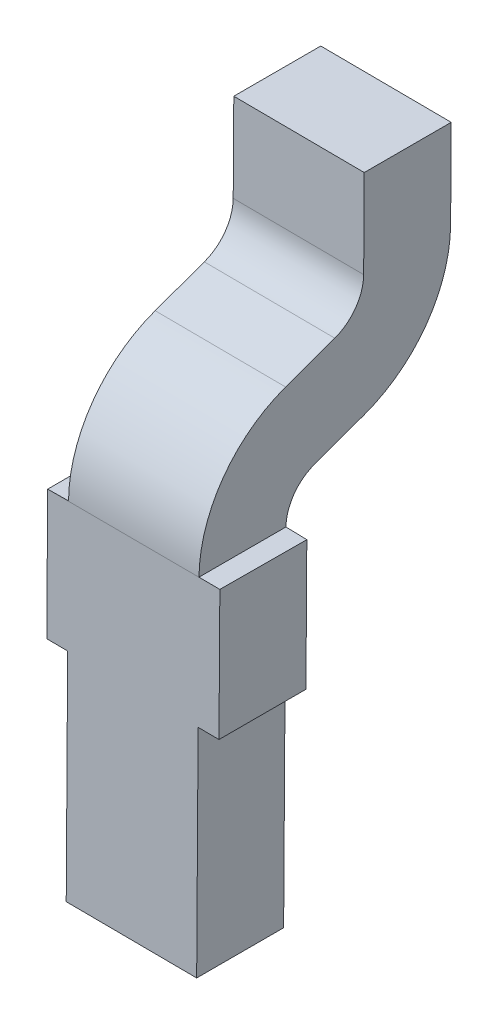
ISO-10303-21;
HEADER;
FILE_DESCRIPTION(('STEP AP214'),'2;1');
FILE_NAME('part.step','',(''),(''),'','','');
FILE_SCHEMA(('AUTOMOTIVE_DESIGN { 1 0 10303 214 1 1 1 1 }'));
ENDSEC;
DATA;
#1=APPLICATION_CONTEXT('core data for automotive mechanical design processes');
#2=APPLICATION_PROTOCOL_DEFINITION('international standard','automotive_design',2000,#1);
#3=PRODUCT_CONTEXT('',#1,'mechanical');
#4=PRODUCT('Part','Part','',(#3));
#5=PRODUCT_RELATED_PRODUCT_CATEGORY('part','',(#4));
#6=PRODUCT_DEFINITION_FORMATION('','',#4);
#7=PRODUCT_DEFINITION_CONTEXT('part definition',#1,'design');
#8=PRODUCT_DEFINITION('design','',#6,#7);
#9=PRODUCT_DEFINITION_SHAPE('','',#8);
#10=(LENGTH_UNIT() NAMED_UNIT(*) SI_UNIT(.MILLI.,.METRE.));
#11=(NAMED_UNIT(*) PLANE_ANGLE_UNIT() SI_UNIT($,.RADIAN.));
#12=(NAMED_UNIT(*) SI_UNIT($,.STERADIAN.) SOLID_ANGLE_UNIT());
#13=UNCERTAINTY_MEASURE_WITH_UNIT(LENGTH_MEASURE(1.E-05),#10,'distance_accuracy_value','');
#14=(GEOMETRIC_REPRESENTATION_CONTEXT(3) GLOBAL_UNCERTAINTY_ASSIGNED_CONTEXT((#13)) GLOBAL_UNIT_ASSIGNED_CONTEXT((#10,
#11,#12)) REPRESENTATION_CONTEXT('',''));
#15=CARTESIAN_POINT('',(0.,0.,0.));
#16=DIRECTION('',(0.,0.,1.));
#17=DIRECTION('',(1.,0.,0.));
#18=AXIS2_PLACEMENT_3D('',#15,#16,#17);
#19=CARTESIAN_POINT('',(199.451691080411,101.660454166907,143.086328634145));
#20=DIRECTION('',(0.99997801670857,-0.00663069374923689,0.));
#21=DIRECTION('',(0.,0.,-1.));
#22=AXIS2_PLACEMENT_3D('',#19,#20,#21);
#23=PLANE('',#22);
#24=DIRECTION('',(0.00663069374923689,0.999978016708569,0.));
#25=VECTOR('',#24,1.);
#26=CARTESIAN_POINT('',(199.439399595291,99.8067695635693,143.151470551509));
#27=LINE('',#26,#25);
#28=CARTESIAN_POINT('',(199.439399595291,99.8067695635693,143.151470551509));
#29=VERTEX_POINT('',#28);
#30=CARTESIAN_POINT('',(199.447703204213,101.059040697707,143.151470551509));
#31=VERTEX_POINT('',#30);
#32=EDGE_CURVE('E67',#29,#31,#27,.T.);
#33=ORIENTED_EDGE('',*,*,#32,.F.);
#34=DIRECTION('',(0.,0.,-1.));
#35=VECTOR('',#34,1.);
#36=CARTESIAN_POINT('',(199.439399595291,99.8067695635693,143.651470551509));
#37=LINE('',#36,#35);
#38=CARTESIAN_POINT('',(199.439399595291,99.8067695635693,143.651470551509));
#39=VERTEX_POINT('',#38);
#40=EDGE_CURVE('E278',#39,#29,#37,.T.);
#41=ORIENTED_EDGE('',*,*,#40,.F.);
#42=DIRECTION('',(-0.00663069374923689,-0.999978016708569,0.));
#43=VECTOR('',#42,1.);
#44=CARTESIAN_POINT('',(199.452660982789,101.806725596986,143.651470551509));
#45=LINE('',#44,#43);
#46=CARTESIAN_POINT('',(199.447703204213,101.059040697707,143.651470551509));
#47=VERTEX_POINT('',#46);
#48=EDGE_CURVE('E417',#47,#39,#45,.T.);
#49=ORIENTED_EDGE('',*,*,#48,.F.);
#50=DIRECTION('',(0.,0.,-1.));
#51=VECTOR('',#50,1.);
#52=CARTESIAN_POINT('',(199.447703204213,101.059040697707,142.648955771372));
#53=LINE('',#52,#51);
#54=EDGE_CURVE('E11',#47,#31,#53,.T.);
#55=ORIENTED_EDGE('',*,*,#54,.T.);
#56=EDGE_LOOP('',(#33,#41,#49,#55));
#57=FACE_BOUND('',#56,.T.);
#58=ADVANCED_FACE('F44',(#57),#23,.F.);
#59=CARTESIAN_POINT('',(205.352573392878,101.019886451118,142.211582908599));
#60=DIRECTION('',(-0.00663069374923689,-0.99997801670857,0.));
#61=DIRECTION('',(-0.99997801670857,0.00663069374923689,0.));
#62=AXIS2_PLACEMENT_3D('',#59,#60,#61);
#63=PLANE('',#62);
#64=ORIENTED_EDGE('',*,*,#54,.F.);
#65=DIRECTION('',(0.999978016708569,-0.00663069374923689,0.));
#66=VECTOR('',#65,1.);
#67=CARTESIAN_POINT('',(202.835128735813,101.036579222631,143.651470551509));
#68=LINE('',#67,#66);
#69=CARTESIAN_POINT('',(199.327705842208,101.059836380957,143.651470551509));
#70=VERTEX_POINT('',#69);
#71=EDGE_CURVE('E300',#70,#47,#68,.T.);
#72=ORIENTED_EDGE('',*,*,#71,.F.);
#73=DIRECTION('',(0.,0.,-1.));
#74=VECTOR('',#73,1.);
#75=CARTESIAN_POINT('',(199.327705842208,101.059836380957,142.648955771372));
#76=LINE('',#75,#74);
#77=CARTESIAN_POINT('',(199.327705842208,101.059836380957,143.151470551509));
#78=VERTEX_POINT('',#77);
#79=EDGE_CURVE('E55',#70,#78,#76,.T.);
#80=ORIENTED_EDGE('',*,*,#79,.T.);
#81=DIRECTION('',(-0.999978016708569,0.00663069374923689,0.));
#82=VECTOR('',#81,1.);
#83=CARTESIAN_POINT('',(202.835128735813,101.036579222631,143.151470551509));
#84=LINE('',#83,#82);
#85=EDGE_CURVE('E264',#31,#78,#84,.T.);
#86=ORIENTED_EDGE('',*,*,#85,.F.);
#87=EDGE_LOOP('',(#64,#72,#80,#86));
#88=FACE_BOUND('',#87,.T.);
#89=ADVANCED_FACE('F505',(#88),#63,.T.);
#90=CARTESIAN_POINT('',(199.331693718406,101.661249850157,143.086328634145));
#91=DIRECTION('',(0.99997801670857,-0.00663069374923689,0.));
#92=DIRECTION('',(0.,0.,-1.));
#93=AXIS2_PLACEMENT_3D('',#90,#91,#92);
#94=PLANE('',#93);
#95=DIRECTION('',(0.00663069374923689,0.999978016708569,0.));
#96=VECTOR('',#95,1.);
#97=CARTESIAN_POINT('',(199.319402233286,99.8075652468193,143.151470551509));
#98=LINE('',#97,#96);
#99=CARTESIAN_POINT('',(199.332663620785,101.807521280236,143.151470551509));
#100=VERTEX_POINT('',#99);
#101=EDGE_CURVE('E267',#78,#100,#98,.T.);
#102=ORIENTED_EDGE('',*,*,#101,.F.);
#103=ORIENTED_EDGE('',*,*,#79,.F.);
#104=DIRECTION('',(-0.00663069374923689,-0.999978016708569,0.));
#105=VECTOR('',#104,1.);
#106=CARTESIAN_POINT('',(199.332663620785,101.807521280236,143.651470551509));
#107=LINE('',#106,#105);
#108=CARTESIAN_POINT('',(199.332663620785,101.807521280236,143.651470551509));
#109=VERTEX_POINT('',#108);
#110=EDGE_CURVE('E295',#109,#70,#107,.T.);
#111=ORIENTED_EDGE('',*,*,#110,.F.);
#112=DIRECTION('',(0.,0.,1.));
#113=VECTOR('',#112,1.);
#114=CARTESIAN_POINT('',(199.33267886252,101.809819893488,142.648955771372));
#115=LINE('',#114,#113);
#116=EDGE_CURVE('E290',#100,#109,#115,.T.);
#117=ORIENTED_EDGE('',*,*,#116,.F.);
#118=EDGE_LOOP('',(#102,#103,#111,#117));
#119=FACE_BOUND('',#118,.T.);
#120=ADVANCED_FACE('F510',(#119),#94,.F.);
#121=CARTESIAN_POINT('',(198.857689304583,101.812969473019,142.211582908599));
#122=DIRECTION('',(0.00663069374923689,0.99997801670857,0.));
#123=DIRECTION('',(0.,0.,-1.));
#124=AXIS2_PLACEMENT_3D('',#121,#122,#123);
#125=PLANE('',#124);
#126=DIRECTION('',(0.999978016708569,-0.00663069374923689,0.));
#127=VECTOR('',#126,1.);
#128=CARTESIAN_POINT('',(200.322657099062,101.803255506676,143.151459983575));
#129=LINE('',#128,#127);
#130=CARTESIAN_POINT('',(199.452676224525,101.809024210238,143.151459983575));
#131=VERTEX_POINT('',#130);
#132=EDGE_CURVE('E321',#100,#131,#129,.T.);
#133=ORIENTED_EDGE('',*,*,#132,.F.);
#134=ORIENTED_EDGE('',*,*,#116,.T.);
#135=DIRECTION('',(0.999978016708569,-0.00663069374923689,0.));
#136=VECTOR('',#135,1.);
#137=CARTESIAN_POINT('',(200.322657099062,101.803255506676,143.651467028931));
#138=LINE('',#137,#136);
#139=CARTESIAN_POINT('',(199.452676224525,101.809024210238,143.651467028931));
#140=VERTEX_POINT('',#139);
#141=EDGE_CURVE('E303',#109,#140,#138,.T.);
#142=ORIENTED_EDGE('',*,*,#141,.T.);
#143=DIRECTION('',(0.,0.,1.));
#144=VECTOR('',#143,1.);
#145=CARTESIAN_POINT('',(199.452676224525,101.809024210238,142.648955771372));
#146=LINE('',#145,#144);
#147=EDGE_CURVE('E307',#131,#140,#146,.T.);
#148=ORIENTED_EDGE('',*,*,#147,.F.);
#149=EDGE_LOOP('',(#133,#134,#142,#148));
#150=FACE_BOUND('',#149,.T.);
#151=ADVANCED_FACE('F399',(#150),#125,.T.);
#152=CARTESIAN_POINT('',(199.451691080411,101.660454166907,143.086328634145));
#153=DIRECTION('',(0.99997801670857,-0.00663069374923689,0.));
#154=DIRECTION('',(0.,0.,-1.));
#155=AXIS2_PLACEMENT_3D('',#152,#153,#154);
#156=PLANE('',#155);
#157=DIRECTION('',(0.00663069374923689,0.999978016708569,0.));
#158=VECTOR('',#157,1.);
#159=CARTESIAN_POINT('',(199.459572146024,102.849001347615,142.211582908599));
#160=LINE('',#159,#158);
#161=CARTESIAN_POINT('',(199.459572146024,102.849001347615,142.211582908599));
#162=VERTEX_POINT('',#161);
#163=CARTESIAN_POINT('',(199.462953799836,103.358990136137,142.211582908599));
#164=VERTEX_POINT('',#163);
#165=EDGE_CURVE('E198',#162,#164,#160,.T.);
#166=ORIENTED_EDGE('',*,*,#165,.F.);
#167=CARTESIAN_POINT('',(199.459572146024,102.849001347615,142.961582908599));
#168=DIRECTION('',(0.99997801670857,-0.00663069374922598,0.));
#169=DIRECTION('',(-0.00623081398683692,-0.939671963249076,-0.342020143325928));
#170=AXIS2_PLACEMENT_3D('',#167,#168,#169);
#171=CIRCLE('',#170,0.749999999999992);
#172=CARTESIAN_POINT('',(199.454899035534,102.144247375179,142.705067801105));
#173=VERTEX_POINT('',#172);
#174=EDGE_CURVE('E202',#173,#162,#171,.T.);
#175=ORIENTED_EDGE('',*,*,#174,.F.);
#176=DIRECTION('',(0.00226783082646436,0.342012624597446,-0.939692620785813));
#177=VECTOR('',#176,1.);
#178=CARTESIAN_POINT('',(199.454218686287,102.041643587799,142.986975587341));
#179=LINE('',#178,#177);
#180=CARTESIAN_POINT('',(199.454218686287,102.041643587799,142.986975587341));
#181=VERTEX_POINT('',#180);
#182=EDGE_CURVE('E241',#181,#173,#179,.T.);
#183=ORIENTED_EDGE('',*,*,#182,.F.);
#184=CARTESIAN_POINT('',(199.452660982789,101.806725596986,142.901470551509));
#185=DIRECTION('',(-0.99997801670857,0.00663069374923689,0.));
#186=DIRECTION('',(0.,0.,1.));
#187=AXIS2_PLACEMENT_3D('',#184,#185,#186);
#188=CIRCLE('',#187,0.25);
#189=EDGE_CURVE('E325',#131,#181,#188,.T.);
#190=ORIENTED_EDGE('',*,*,#189,.F.);
#191=ORIENTED_EDGE('',*,*,#147,.T.);
#192=CARTESIAN_POINT('',(199.452660982789,101.806725596986,142.901470551509));
#193=DIRECTION('',(0.99997801670857,-0.00663069374922598,0.));
#194=DIRECTION('',(0.00623081398683692,0.939671963249076,0.342020143325928));
#195=AXIS2_PLACEMENT_3D('',#192,#193,#194);
#196=CIRCLE('',#195,0.749999999999992);
#197=CARTESIAN_POINT('',(199.457334093279,102.511479569424,143.157985659003));
#198=VERTEX_POINT('',#197);
#199=EDGE_CURVE('E318',#198,#140,#196,.T.);
#200=ORIENTED_EDGE('',*,*,#199,.F.);
#201=DIRECTION('',(-0.00226783082646436,-0.342012624597446,0.939692620785813));
#202=VECTOR('',#201,1.);
#203=CARTESIAN_POINT('',(199.458014442528,102.614083356803,142.876077872768));
#204=LINE('',#203,#202);
#205=CARTESIAN_POINT('',(199.458014442528,102.614083356803,142.876077872768));
#206=VERTEX_POINT('',#205);
#207=EDGE_CURVE('E273',#206,#198,#204,.T.);
#208=ORIENTED_EDGE('',*,*,#207,.F.);
#209=CARTESIAN_POINT('',(199.459572146024,102.849001347615,142.961582908599));
#210=DIRECTION('',(-0.99997801670857,0.00663069374923689,0.));
#211=DIRECTION('',(0.,0.,-1.));
#212=AXIS2_PLACEMENT_3D('',#209,#210,#211);
#213=CIRCLE('',#212,0.25);
#214=CARTESIAN_POINT('',(199.459572146024,102.849001347615,142.711582908599));
#215=VERTEX_POINT('',#214);
#216=EDGE_CURVE('E272',#215,#206,#213,.T.);
#217=ORIENTED_EDGE('',*,*,#216,.F.);
#218=DIRECTION('',(-0.00663069374923689,-0.999978016708569,0.));
#219=VECTOR('',#218,1.);
#220=CARTESIAN_POINT('',(199.462953799836,103.358990136137,142.711582908599));
#221=LINE('',#220,#219);
#222=CARTESIAN_POINT('',(199.462953799836,103.358990136137,142.711582908599));
#223=VERTEX_POINT('',#222);
#224=EDGE_CURVE('E279',#223,#215,#221,.T.);
#225=ORIENTED_EDGE('',*,*,#224,.F.);
#226=DIRECTION('',(0.,0.,1.));
#227=VECTOR('',#226,1.);
#228=CARTESIAN_POINT('',(199.462953799836,103.358990136137,142.211582908599));
#229=LINE('',#228,#227);
#230=EDGE_CURVE('E205',#164,#223,#229,.T.);
#231=ORIENTED_EDGE('',*,*,#230,.F.);
#232=EDGE_LOOP('',(#166,#175,#183,#190,#191,#200,#208,#217,#225,#231));
#233=FACE_BOUND('',#232,.T.);
#234=ADVANCED_FACE('F200',(#233),#156,.F.);
#235=CARTESIAN_POINT('',(200.212937312368,103.354017115825,142.711582908599));
#236=DIRECTION('',(0.,0.,1.));
#237=DIRECTION('',(1.,0.,0.));
#238=AXIS2_PLACEMENT_3D('',#235,#236,#237);
#239=PLANE('',#238);
#240=DIRECTION('',(-0.999978016708569,0.00663069374923689,0.));
#241=VECTOR('',#240,1.);
#242=CARTESIAN_POINT('',(200.212937312368,103.354017115825,142.711582908599));
#243=LINE('',#242,#241);
#244=CARTESIAN_POINT('',(200.212937312368,103.354017115825,142.711582908599));
#245=VERTEX_POINT('',#244);
#246=EDGE_CURVE('E283',#245,#223,#243,.T.);
#247=ORIENTED_EDGE('',*,*,#246,.T.);
#248=ORIENTED_EDGE('',*,*,#224,.T.);
#249=DIRECTION('',(-0.999978016708569,0.00663069374923689,0.));
#250=VECTOR('',#249,1.);
#251=CARTESIAN_POINT('',(200.209555658556,102.844028327303,142.711582908599));
#252=LINE('',#251,#250);
#253=CARTESIAN_POINT('',(200.209555658556,102.844028327303,142.711582908599));
#254=VERTEX_POINT('',#253);
#255=EDGE_CURVE('E284',#254,#215,#252,.T.);
#256=ORIENTED_EDGE('',*,*,#255,.F.);
#257=DIRECTION('',(-0.00663069374923689,-0.999978016708569,0.));
#258=VECTOR('',#257,1.);
#259=CARTESIAN_POINT('',(200.212937312368,103.354017115825,142.711582908599));
#260=LINE('',#259,#258);
#261=EDGE_CURVE('E254',#245,#254,#260,.T.);
#262=ORIENTED_EDGE('',*,*,#261,.F.);
#263=EDGE_LOOP('',(#247,#248,#256,#262));
#264=FACE_BOUND('',#263,.T.);
#265=ADVANCED_FACE('F454',(#264),#239,.T.);
#266=CARTESIAN_POINT('',(200.209555658556,102.844028327303,142.961582908599));
#267=DIRECTION('',(0.99997801670857,-0.00663069374923689,0.));
#268=DIRECTION('',(0.,0.,-1.));
#269=AXIS2_PLACEMENT_3D('',#266,#267,#268);
#270=CYLINDRICAL_SURFACE('',#269,0.25);
#271=ORIENTED_EDGE('',*,*,#255,.T.);
#272=ORIENTED_EDGE('',*,*,#216,.T.);
#273=DIRECTION('',(-0.999978016708569,0.00663069374923689,0.));
#274=VECTOR('',#273,1.);
#275=CARTESIAN_POINT('',(200.207997955059,102.609110336491,142.876077872768));
#276=LINE('',#275,#274);
#277=CARTESIAN_POINT('',(200.207997955059,102.609110336491,142.876077872768));
#278=VERTEX_POINT('',#277);
#279=EDGE_CURVE('E268',#278,#206,#276,.T.);
#280=ORIENTED_EDGE('',*,*,#279,.F.);
#281=CARTESIAN_POINT('',(200.209555658556,102.844028327303,142.961582908599));
#282=DIRECTION('',(-0.99997801670857,0.00663069374923689,0.));
#283=DIRECTION('',(0.,0.,-1.));
#284=AXIS2_PLACEMENT_3D('',#281,#282,#283);
#285=CIRCLE('',#284,0.25);
#286=EDGE_CURVE('E250',#254,#278,#285,.T.);
#287=ORIENTED_EDGE('',*,*,#286,.F.);
#288=EDGE_LOOP('',(#271,#272,#280,#287));
#289=FACE_BOUND('',#288,.T.);
#290=ADVANCED_FACE('F473',(#289),#270,.F.);
#291=CARTESIAN_POINT('',(200.207997955059,102.609110336491,142.876077872768));
#292=DIRECTION('',(0.00623081398684852,0.939671963249075,0.342020143325932));
#293=DIRECTION('',(0.99983409933677,0.,-0.0182146590259127));
#294=AXIS2_PLACEMENT_3D('',#291,#292,#293);
#295=PLANE('',#294);
#296=ORIENTED_EDGE('',*,*,#279,.T.);
#297=ORIENTED_EDGE('',*,*,#207,.T.);
#298=DIRECTION('',(-0.999978016708569,0.00663069374923689,0.));
#299=VECTOR('',#298,1.);
#300=CARTESIAN_POINT('',(200.207317605811,102.506506549112,143.157985659003));
#301=LINE('',#300,#299);
#302=CARTESIAN_POINT('',(200.207317605811,102.506506549112,143.157985659003));
#303=VERTEX_POINT('',#302);
#304=EDGE_CURVE('E348',#303,#198,#301,.T.);
#305=ORIENTED_EDGE('',*,*,#304,.F.);
#306=DIRECTION('',(-0.00226783082646436,-0.342012624597446,0.939692620785813));
#307=VECTOR('',#306,1.);
#308=CARTESIAN_POINT('',(200.207997955059,102.609110336491,142.876077872768));
#309=LINE('',#308,#307);
#310=EDGE_CURVE('E246',#278,#303,#309,.T.);
#311=ORIENTED_EDGE('',*,*,#310,.F.);
#312=EDGE_LOOP('',(#296,#297,#305,#311));
#313=FACE_BOUND('',#312,.T.);
#314=ADVANCED_FACE('F474',(#313),#295,.T.);
#315=CARTESIAN_POINT('',(200.204202198818,102.036670567487,142.986975587341));
#316=DIRECTION('',(-0.00623081398684852,-0.939671963249075,-0.342020143325932));
#317=DIRECTION('',(0.,0.342026782650606,-0.939690204242693));
#318=AXIS2_PLACEMENT_3D('',#315,#316,#317);
#319=PLANE('',#318);
#320=DIRECTION('',(-0.999978016708569,0.00663069374923689,0.));
#321=VECTOR('',#320,1.);
#322=CARTESIAN_POINT('',(200.204202198818,102.036670567487,142.986975587341));
#323=LINE('',#322,#321);
#324=CARTESIAN_POINT('',(200.204202198818,102.036670567487,142.986975587341));
#325=VERTEX_POINT('',#324);
#326=EDGE_CURVE('E291',#325,#181,#323,.T.);
#327=ORIENTED_EDGE('',*,*,#326,.T.);
#328=ORIENTED_EDGE('',*,*,#182,.T.);
#329=DIRECTION('',(-0.999978016708569,0.00663069374923689,0.));
#330=VECTOR('',#329,1.);
#331=CARTESIAN_POINT('',(200.204882548065,102.139274354867,142.705067801105));
#332=LINE('',#331,#330);
#333=CARTESIAN_POINT('',(200.204882548065,102.139274354867,142.705067801105));
#334=VERTEX_POINT('',#333);
#335=EDGE_CURVE('E221',#334,#173,#332,.T.);
#336=ORIENTED_EDGE('',*,*,#335,.F.);
#337=DIRECTION('',(0.00226783082646436,0.342012624597446,-0.939692620785813));
#338=VECTOR('',#337,1.);
#339=CARTESIAN_POINT('',(200.204202198818,102.036670567487,142.986975587341));
#340=LINE('',#339,#338);
#341=EDGE_CURVE('E381',#325,#334,#340,.T.);
#342=ORIENTED_EDGE('',*,*,#341,.F.);
#343=EDGE_LOOP('',(#327,#328,#336,#342));
#344=FACE_BOUND('',#343,.T.);
#345=ADVANCED_FACE('F392',(#344),#319,.T.);
#346=CARTESIAN_POINT('',(200.209555658556,102.844028327303,142.961582908599));
#347=DIRECTION('',(0.99997801670857,-0.00663069374922598,0.));
#348=DIRECTION('',(-0.00623081398683692,-0.939671963249076,-0.342020143325928));
#349=AXIS2_PLACEMENT_3D('',#346,#347,#348);
#350=CYLINDRICAL_SURFACE('',#349,0.749999999999992);
#351=ORIENTED_EDGE('',*,*,#335,.T.);
#352=ORIENTED_EDGE('',*,*,#174,.T.);
#353=DIRECTION('',(-0.999978016708569,0.00663069374923689,0.));
#354=VECTOR('',#353,1.);
#355=CARTESIAN_POINT('',(200.209555658556,102.844028327303,142.211582908599));
#356=LINE('',#355,#354);
#357=CARTESIAN_POINT('',(200.209555658556,102.844028327303,142.211582908599));
#358=VERTEX_POINT('',#357);
#359=EDGE_CURVE('E211',#358,#162,#356,.T.);
#360=ORIENTED_EDGE('',*,*,#359,.F.);
#361=CARTESIAN_POINT('',(200.209555658556,102.844028327303,142.961582908599));
#362=DIRECTION('',(0.99997801670857,-0.00663069374922598,0.));
#363=DIRECTION('',(-0.00623081398683692,-0.939671963249076,-0.342020143325928));
#364=AXIS2_PLACEMENT_3D('',#361,#362,#363);
#365=CIRCLE('',#364,0.749999999999992);
#366=EDGE_CURVE('E257',#334,#358,#365,.T.);
#367=ORIENTED_EDGE('',*,*,#366,.F.);
#368=EDGE_LOOP('',(#351,#352,#360,#367));
#369=FACE_BOUND('',#368,.T.);
#370=ADVANCED_FACE('F217',(#369),#350,.T.);
#371=CARTESIAN_POINT('',(200.209555658556,102.844028327303,142.211582908599));
#372=DIRECTION('',(0.,0.,-1.));
#373=DIRECTION('',(0.,-1.,0.));
#374=AXIS2_PLACEMENT_3D('',#371,#372,#373);
#375=PLANE('',#374);
#376=ORIENTED_EDGE('',*,*,#359,.T.);
#377=ORIENTED_EDGE('',*,*,#165,.T.);
#378=DIRECTION('',(-0.999978016708569,0.00663069374923689,0.));
#379=VECTOR('',#378,1.);
#380=CARTESIAN_POINT('',(200.212937312368,103.354017115825,142.211582908599));
#381=LINE('',#380,#379);
#382=CARTESIAN_POINT('',(200.212937312368,103.354017115825,142.211582908599));
#383=VERTEX_POINT('',#382);
#384=EDGE_CURVE('E212',#383,#164,#381,.T.);
#385=ORIENTED_EDGE('',*,*,#384,.F.);
#386=DIRECTION('',(0.00663069374923689,0.999978016708569,0.));
#387=VECTOR('',#386,1.);
#388=CARTESIAN_POINT('',(200.209555658556,102.844028327303,142.211582908599));
#389=LINE('',#388,#387);
#390=EDGE_CURVE('E225',#358,#383,#389,.T.);
#391=ORIENTED_EDGE('',*,*,#390,.F.);
#392=EDGE_LOOP('',(#376,#377,#385,#391));
#393=FACE_BOUND('',#392,.T.);
#394=ADVANCED_FACE('F224',(#393),#375,.T.);
#395=CARTESIAN_POINT('',(200.212937312368,103.354017115825,142.211582908599));
#396=DIRECTION('',(0.00663069374923689,0.99997801670857,0.));
#397=DIRECTION('',(2.67899092701187E-13,0.,-1.));
#398=AXIS2_PLACEMENT_3D('',#395,#396,#397);
#399=PLANE('',#398);
#400=ORIENTED_EDGE('',*,*,#384,.T.);
#401=ORIENTED_EDGE('',*,*,#230,.T.);
#402=ORIENTED_EDGE('',*,*,#246,.F.);
#403=DIRECTION('',(0.,0.,1.));
#404=VECTOR('',#403,1.);
#405=CARTESIAN_POINT('',(200.212937312368,103.354017115825,142.211582908599));
#406=LINE('',#405,#404);
#407=EDGE_CURVE('E385',#383,#245,#406,.T.);
#408=ORIENTED_EDGE('',*,*,#407,.F.);
#409=EDGE_LOOP('',(#400,#401,#402,#408));
#410=FACE_BOUND('',#409,.T.);
#411=ADVANCED_FACE('F449',(#410),#399,.T.);
#412=CARTESIAN_POINT('',(200.189383107822,99.8017965432574,143.651470551509));
#413=DIRECTION('',(-0.00663069374923689,-0.99997801670857,0.));
#414=DIRECTION('',(-0.99997801670857,0.00663069374923689,0.));
#415=AXIS2_PLACEMENT_3D('',#412,#413,#414);
#416=PLANE('',#415);
#417=DIRECTION('',(-0.999978016708569,0.00663069374923689,0.));
#418=VECTOR('',#417,1.);
#419=CARTESIAN_POINT('',(200.189383107822,99.8017965432574,143.651470551509));
#420=LINE('',#419,#418);
#421=CARTESIAN_POINT('',(200.189383107822,99.8017965432574,143.651470551509));
#422=VERTEX_POINT('',#421);
#423=EDGE_CURVE('E274',#422,#39,#420,.T.);
#424=ORIENTED_EDGE('',*,*,#423,.T.);
#425=ORIENTED_EDGE('',*,*,#40,.T.);
#426=DIRECTION('',(-0.999978016708569,0.00663069374923689,0.));
#427=VECTOR('',#426,1.);
#428=CARTESIAN_POINT('',(200.189383107822,99.8017965432574,143.151470551509));
#429=LINE('',#428,#427);
#430=CARTESIAN_POINT('',(200.189383107822,99.8017965432574,143.151470551509));
#431=VERTEX_POINT('',#430);
#432=EDGE_CURVE('E245',#431,#29,#429,.T.);
#433=ORIENTED_EDGE('',*,*,#432,.F.);
#434=DIRECTION('',(0.,0.,-1.));
#435=VECTOR('',#434,1.);
#436=CARTESIAN_POINT('',(200.189383107822,99.8017965432574,143.651470551509));
#437=LINE('',#436,#435);
#438=EDGE_CURVE('E426',#422,#431,#437,.T.);
#439=ORIENTED_EDGE('',*,*,#438,.F.);
#440=EDGE_LOOP('',(#424,#425,#433,#439));
#441=FACE_BOUND('',#440,.T.);
#442=ADVANCED_FACE('F46',(#441),#416,.T.);
#443=CARTESIAN_POINT('',(200.201674592942,101.655481146595,143.086328634145));
#444=DIRECTION('',(0.99997801670857,-0.00663069374923689,0.));
#445=DIRECTION('',(0.,0.,-1.));
#446=AXIS2_PLACEMENT_3D('',#443,#444,#445);
#447=PLANE('',#446);
#448=ORIENTED_EDGE('',*,*,#407,.T.);
#449=ORIENTED_EDGE('',*,*,#261,.T.);
#450=ORIENTED_EDGE('',*,*,#286,.T.);
#451=ORIENTED_EDGE('',*,*,#310,.T.);
#452=CARTESIAN_POINT('',(200.202644495321,101.801752576675,142.901470551509));
#453=DIRECTION('',(0.99997801670857,-0.00663069374922598,0.));
#454=DIRECTION('',(0.00623081398683692,0.939671963249076,0.342020143325928));
#455=AXIS2_PLACEMENT_3D('',#452,#453,#454);
#456=CIRCLE('',#455,0.749999999999992);
#457=CARTESIAN_POINT('',(200.202659737057,101.804051189926,143.651467028931));
#458=VERTEX_POINT('',#457);
#459=EDGE_CURVE('E251',#303,#458,#456,.T.);
#460=ORIENTED_EDGE('',*,*,#459,.T.);
#461=DIRECTION('',(0.,0.,1.));
#462=VECTOR('',#461,1.);
#463=CARTESIAN_POINT('',(200.202659737057,101.804051189926,142.648955771372));
#464=LINE('',#463,#462);
#465=CARTESIAN_POINT('',(200.202659737057,101.804051189926,143.151459983575));
#466=VERTEX_POINT('',#465);
#467=EDGE_CURVE('E259',#466,#458,#464,.T.);
#468=ORIENTED_EDGE('',*,*,#467,.F.);
#469=CARTESIAN_POINT('',(200.202644495321,101.801752576675,142.901470551509));
#470=DIRECTION('',(-0.99997801670857,0.00663069374923689,0.));
#471=DIRECTION('',(0.,0.,1.));
#472=AXIS2_PLACEMENT_3D('',#469,#470,#471);
#473=CIRCLE('',#472,0.25);
#474=EDGE_CURVE('E377',#466,#325,#473,.T.);
#475=ORIENTED_EDGE('',*,*,#474,.T.);
#476=ORIENTED_EDGE('',*,*,#341,.T.);
#477=ORIENTED_EDGE('',*,*,#366,.T.);
#478=ORIENTED_EDGE('',*,*,#390,.T.);
#479=EDGE_LOOP('',(#448,#449,#450,#451,#460,#468,#475,#476,#477,#478));
#480=FACE_BOUND('',#479,.T.);
#481=ADVANCED_FACE('F458',(#480),#447,.T.);
#482=CARTESIAN_POINT('',(200.201674592942,101.655481146595,143.086328634145));
#483=DIRECTION('',(0.99997801670857,-0.00663069374923689,0.));
#484=DIRECTION('',(0.,0.,-1.));
#485=AXIS2_PLACEMENT_3D('',#482,#483,#484);
#486=PLANE('',#485);
#487=DIRECTION('',(0.,0.,-1.));
#488=VECTOR('',#487,1.);
#489=CARTESIAN_POINT('',(200.197686716744,101.054067677395,142.648955771372));
#490=LINE('',#489,#488);
#491=CARTESIAN_POINT('',(200.197686716744,101.054067677395,143.651470551509));
#492=VERTEX_POINT('',#491);
#493=CARTESIAN_POINT('',(200.197686716744,101.054067677395,143.151470551509));
#494=VERTEX_POINT('',#493);
#495=EDGE_CURVE('E235',#492,#494,#490,.T.);
#496=ORIENTED_EDGE('',*,*,#495,.F.);
#497=DIRECTION('',(-0.00663069374923689,-0.999978016708569,0.));
#498=VECTOR('',#497,1.);
#499=CARTESIAN_POINT('',(200.202644495321,101.801752576675,143.651470551509));
#500=LINE('',#499,#498);
#501=EDGE_CURVE('E258',#492,#422,#500,.T.);
#502=ORIENTED_EDGE('',*,*,#501,.T.);
#503=ORIENTED_EDGE('',*,*,#438,.T.);
#504=DIRECTION('',(0.00663069374923689,0.999978016708569,0.));
#505=VECTOR('',#504,1.);
#506=CARTESIAN_POINT('',(200.189383107822,99.8017965432574,143.151470551509));
#507=LINE('',#506,#505);
#508=EDGE_CURVE('E262',#431,#494,#507,.T.);
#509=ORIENTED_EDGE('',*,*,#508,.T.);
#510=EDGE_LOOP('',(#496,#502,#503,#509));
#511=FACE_BOUND('',#510,.T.);
#512=ADVANCED_FACE('F517',(#511),#486,.T.);
#513=CARTESIAN_POINT('',(198.857689304583,101.812969473019,142.211582908599));
#514=DIRECTION('',(0.00663069374923689,0.99997801670857,0.));
#515=DIRECTION('',(0.,0.,-1.));
#516=AXIS2_PLACEMENT_3D('',#513,#514,#515);
#517=PLANE('',#516);
#518=DIRECTION('',(0.999978016708569,-0.00663069374923689,0.));
#519=VECTOR('',#518,1.);
#520=CARTESIAN_POINT('',(200.322657099062,101.803255506676,143.151459983575));
#521=LINE('',#520,#519);
#522=CARTESIAN_POINT('',(200.322641857326,101.800956893425,143.151470551509));
#523=VERTEX_POINT('',#522);
#524=EDGE_CURVE('E341',#466,#523,#521,.T.);
#525=ORIENTED_EDGE('',*,*,#524,.F.);
#526=ORIENTED_EDGE('',*,*,#467,.T.);
#527=DIRECTION('',(0.999978016708569,-0.00663069374923689,0.));
#528=VECTOR('',#527,1.);
#529=CARTESIAN_POINT('',(200.322657099062,101.803255506676,143.651467028931));
#530=LINE('',#529,#528);
#531=CARTESIAN_POINT('',(200.322657099062,101.803255506676,143.651467028931));
#532=VERTEX_POINT('',#531);
#533=EDGE_CURVE('E263',#458,#532,#530,.T.);
#534=ORIENTED_EDGE('',*,*,#533,.T.);
#535=DIRECTION('',(0.,0.,1.));
#536=VECTOR('',#535,1.);
#537=CARTESIAN_POINT('',(200.322657099062,101.803255506676,142.648955771372));
#538=LINE('',#537,#536);
#539=EDGE_CURVE('E338',#523,#532,#538,.T.);
#540=ORIENTED_EDGE('',*,*,#539,.F.);
#541=EDGE_LOOP('',(#525,#526,#534,#540));
#542=FACE_BOUND('',#541,.T.);
#543=ADVANCED_FACE('F478',(#542),#517,.T.);
#544=CARTESIAN_POINT('',(200.322641857326,101.800956893425,142.901470551509));
#545=DIRECTION('',(0.99997801670857,-0.00663069374922598,0.));
#546=DIRECTION('',(0.00623081398683692,0.939671963249076,0.342020143325928));
#547=AXIS2_PLACEMENT_3D('',#544,#545,#546);
#548=CYLINDRICAL_SURFACE('',#547,0.749999999999992);
#549=DIRECTION('',(-0.999978016708569,0.00663069374923689,0.));
#550=VECTOR('',#549,1.);
#551=CARTESIAN_POINT('',(200.322641857326,101.800956893425,143.651470551509));
#552=LINE('',#551,#550);
#553=EDGE_CURVE('E299',#532,#109,#552,.T.);
#554=ORIENTED_EDGE('',*,*,#553,.F.);
#555=ORIENTED_EDGE('',*,*,#533,.F.);
#556=ORIENTED_EDGE('',*,*,#459,.F.);
#557=ORIENTED_EDGE('',*,*,#304,.T.);
#558=ORIENTED_EDGE('',*,*,#199,.T.);
#559=ORIENTED_EDGE('',*,*,#141,.F.);
#560=EDGE_LOOP('',(#554,#555,#556,#557,#558,#559));
#561=FACE_BOUND('',#560,.T.);
#562=ADVANCED_FACE('F404',(#561),#548,.T.);
#563=CARTESIAN_POINT('',(200.322641857326,101.800956893425,143.651470551509));
#564=DIRECTION('',(0.,0.,1.));
#565=DIRECTION('',(1.,0.,0.));
#566=AXIS2_PLACEMENT_3D('',#563,#564,#565);
#567=PLANE('',#566);
#568=DIRECTION('',(-0.00663069374923689,-0.999978016708569,0.));
#569=VECTOR('',#568,1.);
#570=CARTESIAN_POINT('',(200.322641857326,101.800956893425,143.651470551509));
#571=LINE('',#570,#569);
#572=CARTESIAN_POINT('',(200.317684078749,101.053271994145,143.651470551509));
#573=VERTEX_POINT('',#572);
#574=EDGE_CURVE('E342',#532,#573,#571,.T.);
#575=ORIENTED_EDGE('',*,*,#574,.F.);
#576=ORIENTED_EDGE('',*,*,#553,.T.);
#577=ORIENTED_EDGE('',*,*,#110,.T.);
#578=ORIENTED_EDGE('',*,*,#71,.T.);
#579=ORIENTED_EDGE('',*,*,#48,.T.);
#580=ORIENTED_EDGE('',*,*,#423,.F.);
#581=ORIENTED_EDGE('',*,*,#501,.F.);
#582=DIRECTION('',(0.999978016708569,-0.00663069374923689,0.));
#583=VECTOR('',#582,1.);
#584=CARTESIAN_POINT('',(202.835128735813,101.036579222631,143.651470551509));
#585=LINE('',#584,#583);
#586=EDGE_CURVE('E237',#492,#573,#585,.T.);
#587=ORIENTED_EDGE('',*,*,#586,.T.);
#588=EDGE_LOOP('',(#575,#576,#577,#578,#579,#580,#581,#587));
#589=FACE_BOUND('',#588,.T.);
#590=ADVANCED_FACE('F480',(#589),#567,.T.);
#591=CARTESIAN_POINT('',(205.352573392878,101.019886451118,142.211582908599));
#592=DIRECTION('',(-0.00663069374923689,-0.99997801670857,0.));
#593=DIRECTION('',(-0.99997801670857,0.00663069374923689,0.));
#594=AXIS2_PLACEMENT_3D('',#591,#592,#593);
#595=PLANE('',#594);
#596=DIRECTION('',(0.,0.,-1.));
#597=VECTOR('',#596,1.);
#598=CARTESIAN_POINT('',(200.317684078749,101.053271994145,142.648955771372));
#599=LINE('',#598,#597);
#600=CARTESIAN_POINT('',(200.317684078749,101.053271994145,143.151470551509));
#601=VERTEX_POINT('',#600);
#602=EDGE_CURVE('E233',#573,#601,#599,.T.);
#603=ORIENTED_EDGE('',*,*,#602,.F.);
#604=ORIENTED_EDGE('',*,*,#586,.F.);
#605=ORIENTED_EDGE('',*,*,#495,.T.);
#606=DIRECTION('',(-0.999978016708569,0.00663069374923689,0.));
#607=VECTOR('',#606,1.);
#608=CARTESIAN_POINT('',(202.835128735813,101.036579222631,143.151470551509));
#609=LINE('',#608,#607);
#610=EDGE_CURVE('E238',#601,#494,#609,.T.);
#611=ORIENTED_EDGE('',*,*,#610,.F.);
#612=EDGE_LOOP('',(#603,#604,#605,#611));
#613=FACE_BOUND('',#612,.T.);
#614=ADVANCED_FACE('F501',(#613),#595,.T.);
#615=CARTESIAN_POINT('',(200.309380469827,99.8010008600075,143.151470551509));
#616=DIRECTION('',(0.,0.,-1.));
#617=DIRECTION('',(-1.,0.,0.));
#618=AXIS2_PLACEMENT_3D('',#615,#616,#617);
#619=PLANE('',#618);
#620=DIRECTION('',(0.00663069374923689,0.999978016708569,0.));
#621=VECTOR('',#620,1.);
#622=CARTESIAN_POINT('',(200.309380469827,99.8010008600075,143.151470551509));
#623=LINE('',#622,#621);
#624=EDGE_CURVE('E355',#601,#523,#623,.T.);
#625=ORIENTED_EDGE('',*,*,#624,.F.);
#626=ORIENTED_EDGE('',*,*,#610,.T.);
#627=ORIENTED_EDGE('',*,*,#508,.F.);
#628=ORIENTED_EDGE('',*,*,#432,.T.);
#629=ORIENTED_EDGE('',*,*,#32,.T.);
#630=ORIENTED_EDGE('',*,*,#85,.T.);
#631=ORIENTED_EDGE('',*,*,#101,.T.);
#632=DIRECTION('',(-0.999978016708569,0.00663069374923689,0.));
#633=VECTOR('',#632,1.);
#634=CARTESIAN_POINT('',(200.322641857326,101.800956893425,143.151470551509));
#635=LINE('',#634,#633);
#636=EDGE_CURVE('E324',#523,#100,#635,.T.);
#637=ORIENTED_EDGE('',*,*,#636,.F.);
#638=EDGE_LOOP('',(#625,#626,#627,#628,#629,#630,#631,#637));
#639=FACE_BOUND('',#638,.T.);
#640=ADVANCED_FACE('F490',(#639),#619,.T.);
#641=CARTESIAN_POINT('',(200.322641857326,101.800956893425,142.901470551509));
#642=DIRECTION('',(0.99997801670857,-0.00663069374923689,0.));
#643=DIRECTION('',(0.,0.,1.));
#644=AXIS2_PLACEMENT_3D('',#641,#642,#643);
#645=CYLINDRICAL_SURFACE('',#644,0.25);
#646=ORIENTED_EDGE('',*,*,#636,.T.);
#647=ORIENTED_EDGE('',*,*,#132,.T.);
#648=ORIENTED_EDGE('',*,*,#189,.T.);
#649=ORIENTED_EDGE('',*,*,#326,.F.);
#650=ORIENTED_EDGE('',*,*,#474,.F.);
#651=ORIENTED_EDGE('',*,*,#524,.T.);
#652=EDGE_LOOP('',(#646,#647,#648,#649,#650,#651));
#653=FACE_BOUND('',#652,.T.);
#654=ADVANCED_FACE('F493',(#653),#645,.F.);
#655=CARTESIAN_POINT('',(200.321671954947,101.654685463345,143.086328634145));
#656=DIRECTION('',(0.99997801670857,-0.00663069374923689,0.));
#657=DIRECTION('',(0.,0.,-1.));
#658=AXIS2_PLACEMENT_3D('',#655,#656,#657);
#659=PLANE('',#658);
#660=ORIENTED_EDGE('',*,*,#539,.T.);
#661=ORIENTED_EDGE('',*,*,#574,.T.);
#662=ORIENTED_EDGE('',*,*,#602,.T.);
#663=ORIENTED_EDGE('',*,*,#624,.T.);
#664=EDGE_LOOP('',(#660,#661,#662,#663));
#665=FACE_BOUND('',#664,.T.);
#666=ADVANCED_FACE('F485',(#665),#659,.T.);
#667=CLOSED_SHELL('',(#58,#89,#120,#151,#234,#265,#290,#314,#345,#370,#394,#411,#442,#481,#512,
#543,#562,#590,#614,#640,#654,#666));
#668=MANIFOLD_SOLID_BREP('B2',#667);
#669=ADVANCED_BREP_SHAPE_REPRESENTATION('',(#18,#668),#14);
#670=SHAPE_DEFINITION_REPRESENTATION(#9,#669);
ENDSEC;
END-ISO-10303-21;
